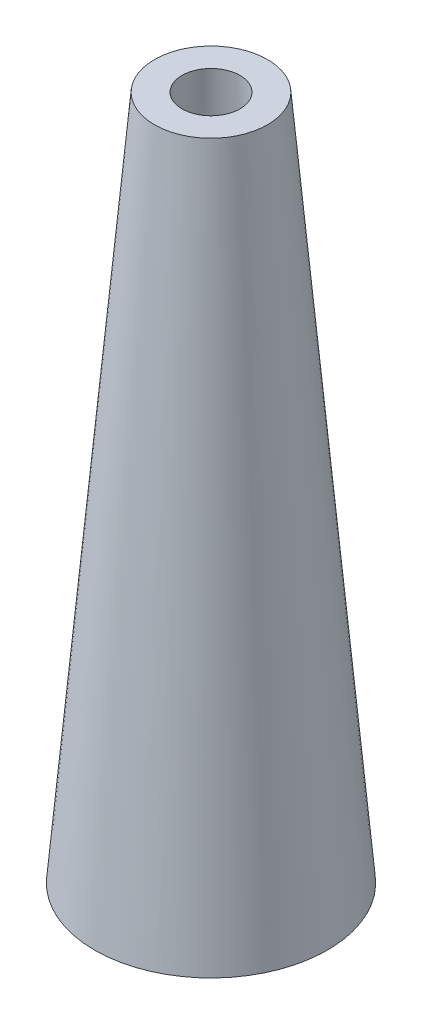
ISO-10303-21;
HEADER;
FILE_DESCRIPTION(('STEP AP214'),'2;1');
FILE_NAME('part.step','',(''),(''),'','','');
FILE_SCHEMA(('AUTOMOTIVE_DESIGN { 1 0 10303 214 1 1 1 1 }'));
ENDSEC;
DATA;
#1=APPLICATION_CONTEXT('core data for automotive mechanical design processes');
#2=APPLICATION_PROTOCOL_DEFINITION('international standard','automotive_design',2000,#1);
#3=PRODUCT_CONTEXT('',#1,'mechanical');
#4=PRODUCT('Part','Part','',(#3));
#5=PRODUCT_RELATED_PRODUCT_CATEGORY('part','',(#4));
#6=PRODUCT_DEFINITION_FORMATION('','',#4);
#7=PRODUCT_DEFINITION_CONTEXT('part definition',#1,'design');
#8=PRODUCT_DEFINITION('design','',#6,#7);
#9=PRODUCT_DEFINITION_SHAPE('','',#8);
#10=(LENGTH_UNIT() NAMED_UNIT(*) SI_UNIT(.MILLI.,.METRE.));
#11=(NAMED_UNIT(*) PLANE_ANGLE_UNIT() SI_UNIT($,.RADIAN.));
#12=(NAMED_UNIT(*) SI_UNIT($,.STERADIAN.) SOLID_ANGLE_UNIT());
#13=UNCERTAINTY_MEASURE_WITH_UNIT(LENGTH_MEASURE(1.E-05),#10,'distance_accuracy_value','');
#14=(GEOMETRIC_REPRESENTATION_CONTEXT(3) GLOBAL_UNCERTAINTY_ASSIGNED_CONTEXT((#13)) GLOBAL_UNIT_ASSIGNED_CONTEXT((#10,
#11,#12)) REPRESENTATION_CONTEXT('',''));
#15=CARTESIAN_POINT('',(0.,0.,0.));
#16=DIRECTION('',(0.,0.,1.));
#17=DIRECTION('',(1.,0.,0.));
#18=AXIS2_PLACEMENT_3D('',#15,#16,#17);
#19=CARTESIAN_POINT('',(0.,0.,0.));
#20=DIRECTION('',(0.,-1.,0.));
#21=DIRECTION('',(0.,0.,-1.));
#22=AXIS2_PLACEMENT_3D('',#19,#20,#21);
#23=CONICAL_SURFACE('',#22,1.12282590509506,0.0698131700797734);
#24=CARTESIAN_POINT('',(0.,10.,0.));
#25=DIRECTION('',(0.,-1.,0.));
#26=DIRECTION('',(0.,0.,-1.));
#27=AXIS2_PLACEMENT_3D('',#24,#25,#26);
#28=CIRCLE('',#27,0.42355778565995);
#29=CARTESIAN_POINT('',(0.,10.,-0.42355778565995));
#30=VERTEX_POINT('',#29);
#31=EDGE_CURVE('E61',#30,#30,#28,.T.);
#32=ORIENTED_EDGE('',*,*,#31,.F.);
#33=EDGE_LOOP('',(#32));
#34=FACE_BOUND('',#33,.T.);
#35=CARTESIAN_POINT('',(0.,1.,0.));
#36=DIRECTION('',(0.,-1.,0.));
#37=DIRECTION('',(0.,0.,-1.));
#38=AXIS2_PLACEMENT_3D('',#35,#36,#37);
#39=CIRCLE('',#38,1.05289909315154);
#40=CARTESIAN_POINT('',(0.,1.,-1.05289909315154));
#41=VERTEX_POINT('',#40);
#42=EDGE_CURVE('E10',#41,#41,#39,.F.);
#43=ORIENTED_EDGE('',*,*,#42,.F.);
#44=EDGE_LOOP('',(#43));
#45=FACE_BOUND('',#44,.T.);
#46=ADVANCED_FACE('F43',(#34,#45),#23,.F.);
#47=CARTESIAN_POINT('',(0.,0.,0.));
#48=DIRECTION('',(0.,-1.,0.));
#49=DIRECTION('',(0.,0.,1.));
#50=AXIS2_PLACEMENT_3D('',#47,#48,#49);
#51=CONICAL_SURFACE('',#50,1.7,0.0872664625997167);
#52=CARTESIAN_POINT('',(0.,10.,0.));
#53=DIRECTION('',(0.,1.,0.));
#54=DIRECTION('',(0.,0.,1.));
#55=AXIS2_PLACEMENT_3D('',#52,#53,#54);
#56=CIRCLE('',#55,0.825113364740758);
#57=CARTESIAN_POINT('',(0.,10.,0.825113364740758));
#58=VERTEX_POINT('',#57);
#59=EDGE_CURVE('E51',#58,#58,#56,.T.);
#60=ORIENTED_EDGE('',*,*,#59,.F.);
#61=EDGE_LOOP('',(#60));
#62=FACE_BOUND('',#61,.T.);
#63=CARTESIAN_POINT('',(0.,0.,0.));
#64=DIRECTION('',(0.,1.,0.));
#65=DIRECTION('',(0.,0.,1.));
#66=AXIS2_PLACEMENT_3D('',#63,#64,#65);
#67=CIRCLE('',#66,1.7);
#68=CARTESIAN_POINT('',(0.,0.,1.7));
#69=VERTEX_POINT('',#68);
#70=EDGE_CURVE('E56',#69,#69,#67,.T.);
#71=ORIENTED_EDGE('',*,*,#70,.T.);
#72=EDGE_LOOP('',(#71));
#73=FACE_BOUND('',#72,.T.);
#74=ADVANCED_FACE('F45',(#62,#73),#51,.T.);
#75=CARTESIAN_POINT('',(0.,10.,0.));
#76=DIRECTION('',(0.,1.,0.));
#77=DIRECTION('',(0.,0.,1.));
#78=AXIS2_PLACEMENT_3D('',#75,#76,#77);
#79=PLANE('',#78);
#80=ORIENTED_EDGE('',*,*,#31,.T.);
#81=EDGE_LOOP('',(#80));
#82=FACE_BOUND('',#81,.T.);
#83=ORIENTED_EDGE('',*,*,#59,.T.);
#84=EDGE_LOOP('',(#83));
#85=FACE_BOUND('',#84,.T.);
#86=ADVANCED_FACE('F153',(#82,#85),#79,.T.);
#87=CARTESIAN_POINT('',(0.,0.,0.));
#88=DIRECTION('',(0.,1.,0.));
#89=DIRECTION('',(0.,0.,1.));
#90=AXIS2_PLACEMENT_3D('',#87,#88,#89);
#91=PLANE('',#90);
#92=CARTESIAN_POINT('',(0.,0.,0.));
#93=DIRECTION('',(0.,-1.,0.));
#94=DIRECTION('',(0.,0.,-1.));
#95=AXIS2_PLACEMENT_3D('',#92,#93,#94);
#96=CIRCLE('',#95,0.19669549311944);
#97=CARTESIAN_POINT('',(0.,0.,-0.19669549311944));
#98=VERTEX_POINT('',#97);
#99=EDGE_CURVE('E132',#98,#98,#96,.T.);
#100=ORIENTED_EDGE('',*,*,#99,.F.);
#101=EDGE_LOOP('',(#100));
#102=FACE_BOUND('',#101,.T.);
#103=CARTESIAN_POINT('',(0.8,0.,0.));
#104=DIRECTION('',(0.,-1.,0.));
#105=DIRECTION('',(0.,0.,-1.));
#106=AXIS2_PLACEMENT_3D('',#103,#104,#105);
#107=CIRCLE('',#106,0.197735832987342);
#108=CARTESIAN_POINT('',(0.8,0.,-0.197735832987342));
#109=VERTEX_POINT('',#108);
#110=EDGE_CURVE('E125',#109,#109,#107,.T.);
#111=ORIENTED_EDGE('',*,*,#110,.F.);
#112=EDGE_LOOP('',(#111));
#113=FACE_BOUND('',#112,.T.);
#114=CARTESIAN_POINT('',(-0.8,0.,0.));
#115=DIRECTION('',(0.,-1.,0.));
#116=DIRECTION('',(0.,0.,-1.));
#117=AXIS2_PLACEMENT_3D('',#114,#115,#116);
#118=CIRCLE('',#117,0.2);
#119=CARTESIAN_POINT('',(-0.8,0.,-0.2));
#120=VERTEX_POINT('',#119);
#121=EDGE_CURVE('E121',#120,#120,#118,.T.);
#122=ORIENTED_EDGE('',*,*,#121,.F.);
#123=EDGE_LOOP('',(#122));
#124=FACE_BOUND('',#123,.T.);
#125=CARTESIAN_POINT('',(0.,0.,-0.8));
#126=DIRECTION('',(0.,-1.,0.));
#127=DIRECTION('',(0.,0.,-1.));
#128=AXIS2_PLACEMENT_3D('',#125,#126,#127);
#129=CIRCLE('',#128,0.197735832987309);
#130=CARTESIAN_POINT('',(0.,0.,-0.997735832987309));
#131=VERTEX_POINT('',#130);
#132=EDGE_CURVE('E113',#131,#131,#129,.T.);
#133=ORIENTED_EDGE('',*,*,#132,.F.);
#134=EDGE_LOOP('',(#133));
#135=FACE_BOUND('',#134,.T.);
#136=CARTESIAN_POINT('',(0.,0.,0.8));
#137=DIRECTION('',(0.,-1.,0.));
#138=DIRECTION('',(0.,0.,-1.));
#139=AXIS2_PLACEMENT_3D('',#136,#137,#138);
#140=CIRCLE('',#139,0.2);
#141=CARTESIAN_POINT('',(0.,0.,0.6));
#142=VERTEX_POINT('',#141);
#143=EDGE_CURVE('E104',#142,#142,#140,.T.);
#144=ORIENTED_EDGE('',*,*,#143,.F.);
#145=EDGE_LOOP('',(#144));
#146=FACE_BOUND('',#145,.T.);
#147=ORIENTED_EDGE('',*,*,#70,.F.);
#148=EDGE_LOOP('',(#147));
#149=FACE_BOUND('',#148,.T.);
#150=CARTESIAN_POINT('',(-0.353553390593273,0.,0.353553390593272));
#151=DIRECTION('',(0.,-1.,0.));
#152=DIRECTION('',(0.,0.,-1.));
#153=AXIS2_PLACEMENT_3D('',#150,#151,#152);
#154=CIRCLE('',#153,0.19711995137448);
#155=CARTESIAN_POINT('',(-0.353553390593273,0.,0.156433439218792));
#156=VERTEX_POINT('',#155);
#157=EDGE_CURVE('E92',#156,#156,#154,.T.);
#158=ORIENTED_EDGE('',*,*,#157,.F.);
#159=EDGE_LOOP('',(#158));
#160=FACE_BOUND('',#159,.T.);
#161=CARTESIAN_POINT('',(-0.353553390593273,0.,-0.353553390593274));
#162=DIRECTION('',(0.,-1.,0.));
#163=DIRECTION('',(0.,0.,-1.));
#164=AXIS2_PLACEMENT_3D('',#161,#162,#163);
#165=CIRCLE('',#164,0.203205658460033);
#166=CARTESIAN_POINT('',(-0.353553390593273,0.,-0.556759049053307));
#167=VERTEX_POINT('',#166);
#168=EDGE_CURVE('E84',#167,#167,#165,.T.);
#169=ORIENTED_EDGE('',*,*,#168,.F.);
#170=EDGE_LOOP('',(#169));
#171=FACE_BOUND('',#170,.T.);
#172=CARTESIAN_POINT('',(0.353553390593276,0.,-0.353553390593272));
#173=DIRECTION('',(0.,-1.,0.));
#174=DIRECTION('',(0.,0.,-1.));
#175=AXIS2_PLACEMENT_3D('',#172,#173,#174);
#176=CIRCLE('',#175,0.196792851307666);
#177=CARTESIAN_POINT('',(0.353553390593276,0.,-0.550346241900938));
#178=VERTEX_POINT('',#177);
#179=EDGE_CURVE('E76',#178,#178,#176,.T.);
#180=ORIENTED_EDGE('',*,*,#179,.F.);
#181=EDGE_LOOP('',(#180));
#182=FACE_BOUND('',#181,.T.);
#183=CARTESIAN_POINT('',(0.353553390593276,0.,0.353553390593272));
#184=DIRECTION('',(0.,-1.,0.));
#185=DIRECTION('',(0.,0.,-1.));
#186=AXIS2_PLACEMENT_3D('',#183,#184,#185);
#187=CIRCLE('',#186,0.199620260457657);
#188=CARTESIAN_POINT('',(0.353553390593276,0.,0.153933130135615));
#189=VERTEX_POINT('',#188);
#190=EDGE_CURVE('E68',#189,#189,#187,.T.);
#191=ORIENTED_EDGE('',*,*,#190,.F.);
#192=EDGE_LOOP('',(#191));
#193=FACE_BOUND('',#192,.T.);
#194=ADVANCED_FACE('F150',(#102,#113,#124,#135,#146,#149,#160,#171,#182,#193),#91,.F.);
#195=CARTESIAN_POINT('',(0.,1.,0.));
#196=DIRECTION('',(0.,-1.,0.));
#197=DIRECTION('',(0.,0.,-1.));
#198=AXIS2_PLACEMENT_3D('',#195,#196,#197);
#199=PLANE('',#198);
#200=CARTESIAN_POINT('',(0.,1.,0.));
#201=DIRECTION('',(0.,-1.,0.));
#202=DIRECTION('',(0.,0.,-1.));
#203=AXIS2_PLACEMENT_3D('',#200,#201,#202);
#204=CIRCLE('',#203,0.19669549311944);
#205=CARTESIAN_POINT('',(0.,1.,-0.19669549311944));
#206=VERTEX_POINT('',#205);
#207=EDGE_CURVE('E105',#206,#206,#204,.T.);
#208=ORIENTED_EDGE('',*,*,#207,.T.);
#209=EDGE_LOOP('',(#208));
#210=FACE_BOUND('',#209,.T.);
#211=CARTESIAN_POINT('',(0.8,1.,0.));
#212=DIRECTION('',(0.,-1.,0.));
#213=DIRECTION('',(0.,0.,-1.));
#214=AXIS2_PLACEMENT_3D('',#211,#212,#213);
#215=CIRCLE('',#214,0.197735832987342);
#216=CARTESIAN_POINT('',(0.8,1.,-0.197735832987342));
#217=VERTEX_POINT('',#216);
#218=EDGE_CURVE('E96',#217,#217,#215,.T.);
#219=ORIENTED_EDGE('',*,*,#218,.T.);
#220=EDGE_LOOP('',(#219));
#221=FACE_BOUND('',#220,.T.);
#222=CARTESIAN_POINT('',(-0.8,1.,0.));
#223=DIRECTION('',(0.,-1.,0.));
#224=DIRECTION('',(0.,0.,-1.));
#225=AXIS2_PLACEMENT_3D('',#222,#223,#224);
#226=CIRCLE('',#225,0.2);
#227=CARTESIAN_POINT('',(-0.8,1.,-0.2));
#228=VERTEX_POINT('',#227);
#229=EDGE_CURVE('E117',#228,#228,#226,.T.);
#230=ORIENTED_EDGE('',*,*,#229,.T.);
#231=EDGE_LOOP('',(#230));
#232=FACE_BOUND('',#231,.T.);
#233=CARTESIAN_POINT('',(0.,1.,-0.8));
#234=DIRECTION('',(0.,-1.,0.));
#235=DIRECTION('',(0.,0.,-1.));
#236=AXIS2_PLACEMENT_3D('',#233,#234,#235);
#237=CIRCLE('',#236,0.197735832987309);
#238=CARTESIAN_POINT('',(0.,1.,-0.997735832987309));
#239=VERTEX_POINT('',#238);
#240=EDGE_CURVE('E109',#239,#239,#237,.T.);
#241=ORIENTED_EDGE('',*,*,#240,.T.);
#242=EDGE_LOOP('',(#241));
#243=FACE_BOUND('',#242,.T.);
#244=CARTESIAN_POINT('',(0.,1.,0.8));
#245=DIRECTION('',(0.,-1.,0.));
#246=DIRECTION('',(0.,0.,-1.));
#247=AXIS2_PLACEMENT_3D('',#244,#245,#246);
#248=CIRCLE('',#247,0.2);
#249=CARTESIAN_POINT('',(0.,1.,0.6));
#250=VERTEX_POINT('',#249);
#251=EDGE_CURVE('E100',#250,#250,#248,.T.);
#252=ORIENTED_EDGE('',*,*,#251,.T.);
#253=EDGE_LOOP('',(#252));
#254=FACE_BOUND('',#253,.T.);
#255=CARTESIAN_POINT('',(0.353553390593276,1.,0.353553390593272));
#256=DIRECTION('',(0.,-1.,0.));
#257=DIRECTION('',(0.,0.,-1.));
#258=AXIS2_PLACEMENT_3D('',#255,#256,#257);
#259=CIRCLE('',#258,0.199620260457657);
#260=CARTESIAN_POINT('',(0.353553390593276,1.,0.153933130135615));
#261=VERTEX_POINT('',#260);
#262=EDGE_CURVE('E67',#261,#261,#259,.T.);
#263=ORIENTED_EDGE('',*,*,#262,.T.);
#264=EDGE_LOOP('',(#263));
#265=FACE_BOUND('',#264,.T.);
#266=CARTESIAN_POINT('',(0.353553390593276,1.,-0.353553390593272));
#267=DIRECTION('',(0.,-1.,0.));
#268=DIRECTION('',(0.,0.,-1.));
#269=AXIS2_PLACEMENT_3D('',#266,#267,#268);
#270=CIRCLE('',#269,0.196792851307666);
#271=CARTESIAN_POINT('',(0.353553390593276,1.,-0.550346241900938));
#272=VERTEX_POINT('',#271);
#273=EDGE_CURVE('E72',#272,#272,#270,.T.);
#274=ORIENTED_EDGE('',*,*,#273,.T.);
#275=EDGE_LOOP('',(#274));
#276=FACE_BOUND('',#275,.T.);
#277=CARTESIAN_POINT('',(-0.353553390593273,1.,-0.353553390593274));
#278=DIRECTION('',(0.,-1.,0.));
#279=DIRECTION('',(0.,0.,-1.));
#280=AXIS2_PLACEMENT_3D('',#277,#278,#279);
#281=CIRCLE('',#280,0.203205658460033);
#282=CARTESIAN_POINT('',(-0.353553390593273,1.,-0.556759049053307));
#283=VERTEX_POINT('',#282);
#284=EDGE_CURVE('E80',#283,#283,#281,.T.);
#285=ORIENTED_EDGE('',*,*,#284,.T.);
#286=EDGE_LOOP('',(#285));
#287=FACE_BOUND('',#286,.T.);
#288=CARTESIAN_POINT('',(-0.353553390593273,1.,0.353553390593272));
#289=DIRECTION('',(0.,-1.,0.));
#290=DIRECTION('',(0.,0.,-1.));
#291=AXIS2_PLACEMENT_3D('',#288,#289,#290);
#292=CIRCLE('',#291,0.19711995137448);
#293=CARTESIAN_POINT('',(-0.353553390593273,1.,0.156433439218792));
#294=VERTEX_POINT('',#293);
#295=EDGE_CURVE('E88',#294,#294,#292,.T.);
#296=ORIENTED_EDGE('',*,*,#295,.T.);
#297=EDGE_LOOP('',(#296));
#298=FACE_BOUND('',#297,.T.);
#299=ORIENTED_EDGE('',*,*,#42,.T.);
#300=EDGE_LOOP('',(#299));
#301=FACE_BOUND('',#300,.T.);
#302=ADVANCED_FACE('F140',(#210,#221,#232,#243,#254,#265,#276,#287,#298,#301),#199,.F.);
#303=CARTESIAN_POINT('',(0.353553390593276,1.,0.353553390593272));
#304=DIRECTION('',(0.,-1.,0.));
#305=DIRECTION('',(0.,0.,-1.));
#306=AXIS2_PLACEMENT_3D('',#303,#304,#305);
#307=CYLINDRICAL_SURFACE('',#306,0.199620260457657);
#308=ORIENTED_EDGE('',*,*,#262,.F.);
#309=EDGE_LOOP('',(#308));
#310=FACE_BOUND('',#309,.T.);
#311=ORIENTED_EDGE('',*,*,#190,.T.);
#312=EDGE_LOOP('',(#311));
#313=FACE_BOUND('',#312,.T.);
#314=ADVANCED_FACE('F172',(#310,#313),#307,.F.);
#315=CARTESIAN_POINT('',(0.353553390593276,1.,-0.353553390593272));
#316=DIRECTION('',(0.,-1.,0.));
#317=DIRECTION('',(0.,0.,-1.));
#318=AXIS2_PLACEMENT_3D('',#315,#316,#317);
#319=CYLINDRICAL_SURFACE('',#318,0.196792851307666);
#320=ORIENTED_EDGE('',*,*,#273,.F.);
#321=EDGE_LOOP('',(#320));
#322=FACE_BOUND('',#321,.T.);
#323=ORIENTED_EDGE('',*,*,#179,.T.);
#324=EDGE_LOOP('',(#323));
#325=FACE_BOUND('',#324,.T.);
#326=ADVANCED_FACE('F174',(#322,#325),#319,.F.);
#327=CARTESIAN_POINT('',(-0.353553390593273,1.,-0.353553390593274));
#328=DIRECTION('',(0.,-1.,0.));
#329=DIRECTION('',(0.,0.,-1.));
#330=AXIS2_PLACEMENT_3D('',#327,#328,#329);
#331=CYLINDRICAL_SURFACE('',#330,0.203205658460033);
#332=ORIENTED_EDGE('',*,*,#284,.F.);
#333=EDGE_LOOP('',(#332));
#334=FACE_BOUND('',#333,.T.);
#335=ORIENTED_EDGE('',*,*,#168,.T.);
#336=EDGE_LOOP('',(#335));
#337=FACE_BOUND('',#336,.T.);
#338=ADVANCED_FACE('F181',(#334,#337),#331,.F.);
#339=CARTESIAN_POINT('',(-0.353553390593273,1.,0.353553390593272));
#340=DIRECTION('',(0.,-1.,0.));
#341=DIRECTION('',(0.,0.,-1.));
#342=AXIS2_PLACEMENT_3D('',#339,#340,#341);
#343=CYLINDRICAL_SURFACE('',#342,0.19711995137448);
#344=ORIENTED_EDGE('',*,*,#295,.F.);
#345=EDGE_LOOP('',(#344));
#346=FACE_BOUND('',#345,.T.);
#347=ORIENTED_EDGE('',*,*,#157,.T.);
#348=EDGE_LOOP('',(#347));
#349=FACE_BOUND('',#348,.T.);
#350=ADVANCED_FACE('F239',(#346,#349),#343,.F.);
#351=CARTESIAN_POINT('',(0.,1.,0.8));
#352=DIRECTION('',(0.,-1.,0.));
#353=DIRECTION('',(0.,0.,-1.));
#354=AXIS2_PLACEMENT_3D('',#351,#352,#353);
#355=CYLINDRICAL_SURFACE('',#354,0.2);
#356=ORIENTED_EDGE('',*,*,#251,.F.);
#357=EDGE_LOOP('',(#356));
#358=FACE_BOUND('',#357,.T.);
#359=ORIENTED_EDGE('',*,*,#143,.T.);
#360=EDGE_LOOP('',(#359));
#361=FACE_BOUND('',#360,.T.);
#362=ADVANCED_FACE('F248',(#358,#361),#355,.F.);
#363=CARTESIAN_POINT('',(0.,1.,-0.8));
#364=DIRECTION('',(0.,-1.,0.));
#365=DIRECTION('',(0.,0.,-1.));
#366=AXIS2_PLACEMENT_3D('',#363,#364,#365);
#367=CYLINDRICAL_SURFACE('',#366,0.197735832987309);
#368=ORIENTED_EDGE('',*,*,#240,.F.);
#369=EDGE_LOOP('',(#368));
#370=FACE_BOUND('',#369,.T.);
#371=ORIENTED_EDGE('',*,*,#132,.T.);
#372=EDGE_LOOP('',(#371));
#373=FACE_BOUND('',#372,.T.);
#374=ADVANCED_FACE('F257',(#370,#373),#367,.F.);
#375=CARTESIAN_POINT('',(-0.8,1.,0.));
#376=DIRECTION('',(0.,-1.,0.));
#377=DIRECTION('',(0.,0.,-1.));
#378=AXIS2_PLACEMENT_3D('',#375,#376,#377);
#379=CYLINDRICAL_SURFACE('',#378,0.2);
#380=ORIENTED_EDGE('',*,*,#229,.F.);
#381=EDGE_LOOP('',(#380));
#382=FACE_BOUND('',#381,.T.);
#383=ORIENTED_EDGE('',*,*,#121,.T.);
#384=EDGE_LOOP('',(#383));
#385=FACE_BOUND('',#384,.T.);
#386=ADVANCED_FACE('F266',(#382,#385),#379,.F.);
#387=CARTESIAN_POINT('',(0.8,1.,0.));
#388=DIRECTION('',(0.,-1.,0.));
#389=DIRECTION('',(0.,0.,-1.));
#390=AXIS2_PLACEMENT_3D('',#387,#388,#389);
#391=CYLINDRICAL_SURFACE('',#390,0.197735832987342);
#392=ORIENTED_EDGE('',*,*,#218,.F.);
#393=EDGE_LOOP('',(#392));
#394=FACE_BOUND('',#393,.T.);
#395=ORIENTED_EDGE('',*,*,#110,.T.);
#396=EDGE_LOOP('',(#395));
#397=FACE_BOUND('',#396,.T.);
#398=ADVANCED_FACE('F146',(#394,#397),#391,.F.);
#399=CARTESIAN_POINT('',(0.,1.,0.));
#400=DIRECTION('',(0.,-1.,0.));
#401=DIRECTION('',(0.,0.,-1.));
#402=AXIS2_PLACEMENT_3D('',#399,#400,#401);
#403=CYLINDRICAL_SURFACE('',#402,0.19669549311944);
#404=ORIENTED_EDGE('',*,*,#207,.F.);
#405=EDGE_LOOP('',(#404));
#406=FACE_BOUND('',#405,.T.);
#407=ORIENTED_EDGE('',*,*,#99,.T.);
#408=EDGE_LOOP('',(#407));
#409=FACE_BOUND('',#408,.T.);
#410=ADVANCED_FACE('F143',(#406,#409),#403,.F.);
#411=CLOSED_SHELL('',(#46,#74,#86,#194,#302,#314,#326,#338,#350,#362,#374,#386,#398,#410));
#412=MANIFOLD_SOLID_BREP('B2',#411);
#413=ADVANCED_BREP_SHAPE_REPRESENTATION('',(#18,#412),#14);
#414=SHAPE_DEFINITION_REPRESENTATION(#9,#413);
ENDSEC;
END-ISO-10303-21;
